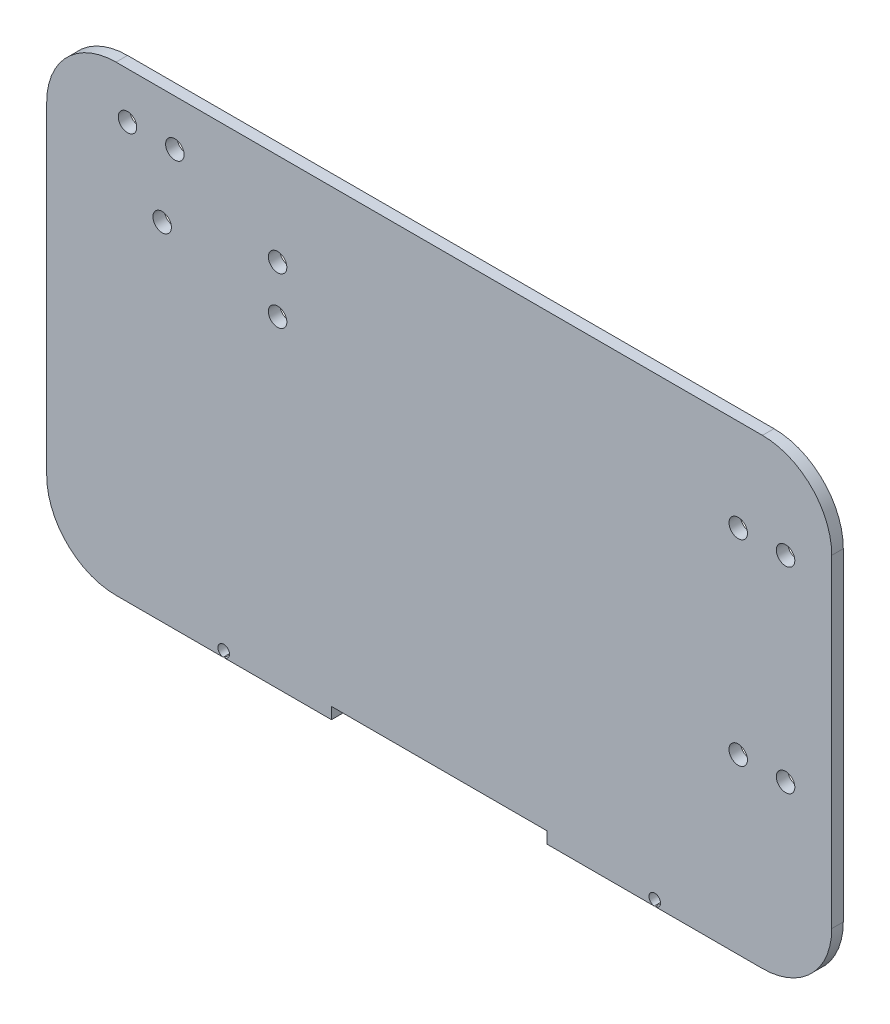
ISO-10303-21;
HEADER;
FILE_DESCRIPTION(('STEP AP214'),'2;1');
FILE_NAME('part.step','',(''),(''),'','','');
FILE_SCHEMA(('AUTOMOTIVE_DESIGN { 1 0 10303 214 1 1 1 1 }'));
ENDSEC;
DATA;
#1=APPLICATION_CONTEXT('core data for automotive mechanical design processes');
#2=APPLICATION_PROTOCOL_DEFINITION('international standard','automotive_design',2000,#1);
#3=PRODUCT_CONTEXT('',#1,'mechanical');
#4=PRODUCT('Part','Part','',(#3));
#5=PRODUCT_RELATED_PRODUCT_CATEGORY('part','',(#4));
#6=PRODUCT_DEFINITION_FORMATION('','',#4);
#7=PRODUCT_DEFINITION_CONTEXT('part definition',#1,'design');
#8=PRODUCT_DEFINITION('design','',#6,#7);
#9=PRODUCT_DEFINITION_SHAPE('','',#8);
#10=(LENGTH_UNIT() NAMED_UNIT(*) SI_UNIT(.MILLI.,.METRE.));
#11=(NAMED_UNIT(*) PLANE_ANGLE_UNIT() SI_UNIT($,.RADIAN.));
#12=(NAMED_UNIT(*) SI_UNIT($,.STERADIAN.) SOLID_ANGLE_UNIT());
#13=UNCERTAINTY_MEASURE_WITH_UNIT(LENGTH_MEASURE(1.E-05),#10,'distance_accuracy_value','');
#14=(GEOMETRIC_REPRESENTATION_CONTEXT(3) GLOBAL_UNCERTAINTY_ASSIGNED_CONTEXT((#13)) GLOBAL_UNIT_ASSIGNED_CONTEXT((#10,
#11,#12)) REPRESENTATION_CONTEXT('',''));
#15=CARTESIAN_POINT('',(0.,0.,0.));
#16=DIRECTION('',(0.,0.,1.));
#17=DIRECTION('',(1.,0.,0.));
#18=AXIS2_PLACEMENT_3D('',#15,#16,#17);
#19=CARTESIAN_POINT('',(-125.47242970477,-88.332065652522,5.));
#20=DIRECTION('',(0.,1.,0.));
#21=DIRECTION('',(0.,0.,1.));
#22=AXIS2_PLACEMENT_3D('',#19,#20,#21);
#23=PLANE('',#22);
#24=DIRECTION('',(1.,0.,0.));
#25=VECTOR('',#24,1.);
#26=CARTESIAN_POINT('',(-125.47242970477,-88.332065652522,0.));
#27=LINE('',#26,#25);
#28=CARTESIAN_POINT('',(61.1942369618966,-88.332065652522,0.));
#29=VERTEX_POINT('',#28);
#30=CARTESIAN_POINT('',(107.637520549526,-88.332065652522,0.));
#31=VERTEX_POINT('',#30);
#32=EDGE_CURVE('E160',#29,#31,#27,.T.);
#33=ORIENTED_EDGE('',*,*,#32,.T.);
#34=DIRECTION('',(0.,0.,1.));
#35=VECTOR('',#34,1.);
#36=CARTESIAN_POINT('',(107.637520549526,-88.332065652522,-5.));
#37=LINE('',#36,#35);
#38=CARTESIAN_POINT('',(107.637520549526,-88.332065652522,5.));
#39=VERTEX_POINT('',#38);
#40=EDGE_CURVE('E11',#31,#39,#37,.T.);
#41=ORIENTED_EDGE('',*,*,#40,.T.);
#42=DIRECTION('',(1.,0.,0.));
#43=VECTOR('',#42,1.);
#44=CARTESIAN_POINT('',(-125.47242970477,-88.332065652522,5.));
#45=LINE('',#44,#43);
#46=CARTESIAN_POINT('',(61.1942369618966,-88.332065652522,5.));
#47=VERTEX_POINT('',#46);
#48=EDGE_CURVE('E158',#47,#39,#45,.T.);
#49=ORIENTED_EDGE('',*,*,#48,.F.);
#50=DIRECTION('',(0.,0.,1.));
#51=VECTOR('',#50,1.);
#52=CARTESIAN_POINT('',(61.1942369618966,-88.332065652522,5.));
#53=LINE('',#52,#51);
#54=EDGE_CURVE('E239',#29,#47,#53,.T.);
#55=ORIENTED_EDGE('',*,*,#54,.F.);
#56=EDGE_LOOP('',(#33,#41,#49,#55));
#57=FACE_BOUND('',#56,.T.);
#58=ADVANCED_FACE('F37',(#57),#23,.F.);
#59=CARTESIAN_POINT('',(-125.47242970477,-88.332065652522,0.));
#60=VERTEX_POINT('',#59);
#61=CARTESIAN_POINT('',(-79.02914611714,-88.332065652522,0.));
#62=VERTEX_POINT('',#61);
#63=EDGE_CURVE('E197',#60,#62,#27,.T.);
#64=ORIENTED_EDGE('',*,*,#63,.T.);
#65=DIRECTION('',(0.,0.,1.));
#66=VECTOR('',#65,1.);
#67=CARTESIAN_POINT('',(-79.02914611714,-88.332065652522,-5.));
#68=LINE('',#67,#66);
#69=CARTESIAN_POINT('',(-79.02914611714,-88.332065652522,5.));
#70=VERTEX_POINT('',#69);
#71=EDGE_CURVE('E245',#62,#70,#68,.T.);
#72=ORIENTED_EDGE('',*,*,#71,.T.);
#73=CARTESIAN_POINT('',(-125.47242970477,-88.332065652522,5.));
#74=VERTEX_POINT('',#73);
#75=EDGE_CURVE('E170',#74,#70,#45,.T.);
#76=ORIENTED_EDGE('',*,*,#75,.F.);
#77=DIRECTION('',(0.,0.,-1.));
#78=VECTOR('',#77,1.);
#79=CARTESIAN_POINT('',(-125.47242970477,-88.332065652522,5.));
#80=LINE('',#79,#78);
#81=EDGE_CURVE('E233',#74,#60,#80,.T.);
#82=ORIENTED_EDGE('',*,*,#81,.T.);
#83=EDGE_LOOP('',(#64,#72,#76,#82));
#84=FACE_BOUND('',#83,.T.);
#85=ADVANCED_FACE('F337',(#84),#23,.F.);
#86=CARTESIAN_POINT('',(-125.47242970477,-58.332065652522,5.));
#87=DIRECTION('',(0.,0.,1.));
#88=DIRECTION('',(1.,0.,0.));
#89=AXIS2_PLACEMENT_3D('',#86,#87,#88);
#90=PLANE('',#89);
#91=CARTESIAN_POINT('',(107.860903628563,-85.842065652522,5.));
#92=DIRECTION('',(0.,0.,1.));
#93=DIRECTION('',(-1.,0.,0.));
#94=AXIS2_PLACEMENT_3D('',#91,#92,#93);
#95=CIRCLE('',#94,2.5);
#96=CARTESIAN_POINT('',(108.0842867076,-88.332065652522,5.));
#97=VERTEX_POINT('',#96);
#98=EDGE_CURVE('E148',#97,#39,#95,.T.);
#99=ORIENTED_EDGE('',*,*,#98,.F.);
#100=CARTESIAN_POINT('',(154.52757029523,-88.332065652522,5.));
#101=VERTEX_POINT('',#100);
#102=EDGE_CURVE('E168',#97,#101,#45,.T.);
#103=ORIENTED_EDGE('',*,*,#102,.T.);
#104=CARTESIAN_POINT('',(154.52757029523,-58.332065652522,5.));
#105=DIRECTION('',(0.,0.,1.));
#106=DIRECTION('',(1.,0.,0.));
#107=AXIS2_PLACEMENT_3D('',#104,#105,#106);
#108=CIRCLE('',#107,30.);
#109=CARTESIAN_POINT('',(184.52757029523,-58.332065652522,5.));
#110=VERTEX_POINT('',#109);
#111=EDGE_CURVE('E175',#101,#110,#108,.T.);
#112=ORIENTED_EDGE('',*,*,#111,.T.);
#113=DIRECTION('',(0.,1.,0.));
#114=VECTOR('',#113,1.);
#115=CARTESIAN_POINT('',(184.52757029523,-58.332065652522,5.));
#116=LINE('',#115,#114);
#117=CARTESIAN_POINT('',(184.52757029523,81.667934347478,5.));
#118=VERTEX_POINT('',#117);
#119=EDGE_CURVE('E178',#110,#118,#116,.T.);
#120=ORIENTED_EDGE('',*,*,#119,.T.);
#121=CARTESIAN_POINT('',(154.52757029523,81.667934347478,5.));
#122=DIRECTION('',(0.,0.,1.));
#123=DIRECTION('',(1.,0.,0.));
#124=AXIS2_PLACEMENT_3D('',#121,#122,#123);
#125=CIRCLE('',#124,30.);
#126=CARTESIAN_POINT('',(154.52757029523,111.667934347478,5.));
#127=VERTEX_POINT('',#126);
#128=EDGE_CURVE('E181',#118,#127,#125,.T.);
#129=ORIENTED_EDGE('',*,*,#128,.T.);
#130=DIRECTION('',(-1.,0.,0.));
#131=VECTOR('',#130,1.);
#132=CARTESIAN_POINT('',(154.52757029523,111.667934347478,5.));
#133=LINE('',#132,#131);
#134=CARTESIAN_POINT('',(-125.47242970477,111.667934347478,5.));
#135=VERTEX_POINT('',#134);
#136=EDGE_CURVE('E185',#127,#135,#133,.T.);
#137=ORIENTED_EDGE('',*,*,#136,.T.);
#138=CARTESIAN_POINT('',(-125.47242970477,81.667934347478,5.));
#139=DIRECTION('',(0.,0.,1.));
#140=DIRECTION('',(1.,0.,0.));
#141=AXIS2_PLACEMENT_3D('',#138,#139,#140);
#142=CIRCLE('',#141,30.);
#143=CARTESIAN_POINT('',(-155.47242970477,81.667934347478,5.));
#144=VERTEX_POINT('',#143);
#145=EDGE_CURVE('E187',#135,#144,#142,.T.);
#146=ORIENTED_EDGE('',*,*,#145,.T.);
#147=DIRECTION('',(0.,-1.,0.));
#148=VECTOR('',#147,1.);
#149=CARTESIAN_POINT('',(-155.47242970477,81.667934347478,5.));
#150=LINE('',#149,#148);
#151=CARTESIAN_POINT('',(-155.47242970477,-58.3320656525218,5.));
#152=VERTEX_POINT('',#151);
#153=EDGE_CURVE('E189',#144,#152,#150,.T.);
#154=ORIENTED_EDGE('',*,*,#153,.T.);
#155=CARTESIAN_POINT('',(-125.47242970477,-58.332065652522,5.));
#156=DIRECTION('',(0.,0.,1.));
#157=DIRECTION('',(1.,0.,0.));
#158=AXIS2_PLACEMENT_3D('',#155,#156,#157);
#159=CIRCLE('',#158,30.);
#160=EDGE_CURVE('E171',#152,#74,#159,.T.);
#161=ORIENTED_EDGE('',*,*,#160,.T.);
#162=ORIENTED_EDGE('',*,*,#75,.T.);
#163=CARTESIAN_POINT('',(-78.8057630381032,-85.842065652522,5.));
#164=DIRECTION('',(0.,0.,1.));
#165=DIRECTION('',(1.,0.,0.));
#166=AXIS2_PLACEMENT_3D('',#163,#164,#165);
#167=CIRCLE('',#166,2.5);
#168=CARTESIAN_POINT('',(-78.5823799590665,-88.332065652522,5.));
#169=VERTEX_POINT('',#168);
#170=EDGE_CURVE('E339',#169,#70,#167,.T.);
#171=ORIENTED_EDGE('',*,*,#170,.F.);
#172=CARTESIAN_POINT('',(-32.1390963714366,-88.332065652522,5.));
#173=VERTEX_POINT('',#172);
#174=EDGE_CURVE('E167',#169,#173,#45,.T.);
#175=ORIENTED_EDGE('',*,*,#174,.T.);
#176=DIRECTION('',(0.,-1.,0.));
#177=VECTOR('',#176,1.);
#178=CARTESIAN_POINT('',(-32.1390963714366,0.,5.));
#179=LINE('',#178,#177);
#180=CARTESIAN_POINT('',(-32.1390963714366,-83.332065652522,5.));
#181=VERTEX_POINT('',#180);
#182=EDGE_CURVE('E267',#181,#173,#179,.T.);
#183=ORIENTED_EDGE('',*,*,#182,.F.);
#184=DIRECTION('',(1.,0.,0.));
#185=VECTOR('',#184,1.);
#186=CARTESIAN_POINT('',(0.,-83.332065652522,5.));
#187=LINE('',#186,#185);
#188=CARTESIAN_POINT('',(61.1942369618966,-83.332065652522,5.));
#189=VERTEX_POINT('',#188);
#190=EDGE_CURVE('E341',#181,#189,#187,.T.);
#191=ORIENTED_EDGE('',*,*,#190,.T.);
#192=DIRECTION('',(0.,-1.,0.));
#193=VECTOR('',#192,1.);
#194=CARTESIAN_POINT('',(61.1942369618966,0.,5.));
#195=LINE('',#194,#193);
#196=EDGE_CURVE('E166',#189,#47,#195,.T.);
#197=ORIENTED_EDGE('',*,*,#196,.T.);
#198=ORIENTED_EDGE('',*,*,#48,.T.);
#199=EDGE_LOOP('',(#99,#103,#112,#120,#129,#137,#146,#154,#161,#162,#171,#175,#183,#191,#197,#198));
#200=FACE_BOUND('',#199,.T.);
#201=CARTESIAN_POINT('',(-99.9724297047701,91.667934347478,5.));
#202=DIRECTION('',(0.,0.,1.));
#203=DIRECTION('',(1.,0.,0.));
#204=AXIS2_PLACEMENT_3D('',#201,#202,#203);
#205=CIRCLE('',#204,3.99999999999999);
#206=CARTESIAN_POINT('',(-95.9724297047701,91.667934347478,5.));
#207=VERTEX_POINT('',#206);
#208=EDGE_CURVE('E285',#207,#207,#205,.T.);
#209=ORIENTED_EDGE('',*,*,#208,.F.);
#210=EDGE_LOOP('',(#209));
#211=FACE_BOUND('',#210,.T.);
#212=CARTESIAN_POINT('',(144.02757029523,71.667934347478,5.));
#213=DIRECTION('',(0.,0.,1.));
#214=DIRECTION('',(1.,0.,0.));
#215=AXIS2_PLACEMENT_3D('',#212,#213,#214);
#216=CIRCLE('',#215,3.99999999999999);
#217=CARTESIAN_POINT('',(148.02757029523,71.667934347478,5.));
#218=VERTEX_POINT('',#217);
#219=EDGE_CURVE('E297',#218,#218,#216,.T.);
#220=ORIENTED_EDGE('',*,*,#219,.F.);
#221=EDGE_LOOP('',(#220));
#222=FACE_BOUND('',#221,.T.);
#223=CARTESIAN_POINT('',(144.02757029523,-13.332065652522,5.));
#224=DIRECTION('',(0.,0.,1.));
#225=DIRECTION('',(1.,0.,0.));
#226=AXIS2_PLACEMENT_3D('',#223,#224,#225);
#227=CIRCLE('',#226,3.99999999999999);
#228=CARTESIAN_POINT('',(148.02757029523,-13.332065652522,5.));
#229=VERTEX_POINT('',#228);
#230=EDGE_CURVE('E309',#229,#229,#227,.T.);
#231=ORIENTED_EDGE('',*,*,#230,.F.);
#232=EDGE_LOOP('',(#231));
#233=FACE_BOUND('',#232,.T.);
#234=CARTESIAN_POINT('',(-55.4724297047701,71.667934347478,5.));
#235=DIRECTION('',(0.,0.,1.));
#236=DIRECTION('',(1.,0.,0.));
#237=AXIS2_PLACEMENT_3D('',#234,#235,#236);
#238=CIRCLE('',#237,4.00000000000001);
#239=CARTESIAN_POINT('',(-51.4724297047701,71.667934347478,5.));
#240=VERTEX_POINT('',#239);
#241=EDGE_CURVE('E321',#240,#240,#238,.T.);
#242=ORIENTED_EDGE('',*,*,#241,.F.);
#243=EDGE_LOOP('',(#242));
#244=FACE_BOUND('',#243,.T.);
#245=CARTESIAN_POINT('',(-105.47242970477,61.667934347478,5.));
#246=DIRECTION('',(0.,0.,1.));
#247=DIRECTION('',(1.,0.,0.));
#248=AXIS2_PLACEMENT_3D('',#245,#246,#247);
#249=CIRCLE('',#248,4.00000000000001);
#250=CARTESIAN_POINT('',(-101.47242970477,61.667934347478,5.));
#251=VERTEX_POINT('',#250);
#252=EDGE_CURVE('E196',#251,#251,#249,.T.);
#253=ORIENTED_EDGE('',*,*,#252,.F.);
#254=EDGE_LOOP('',(#253));
#255=FACE_BOUND('',#254,.T.);
#256=CARTESIAN_POINT('',(-55.4724297047701,51.167934347478,5.));
#257=DIRECTION('',(0.,0.,1.));
#258=DIRECTION('',(1.,0.,0.));
#259=AXIS2_PLACEMENT_3D('',#256,#257,#258);
#260=CIRCLE('',#259,4.00000000000001);
#261=CARTESIAN_POINT('',(-51.4724297047701,51.167934347478,5.));
#262=VERTEX_POINT('',#261);
#263=EDGE_CURVE('E315',#262,#262,#260,.T.);
#264=ORIENTED_EDGE('',*,*,#263,.F.);
#265=EDGE_LOOP('',(#264));
#266=FACE_BOUND('',#265,.T.);
#267=CARTESIAN_POINT('',(164.52757029523,-13.332065652522,5.));
#268=DIRECTION('',(0.,0.,1.));
#269=DIRECTION('',(1.,0.,0.));
#270=AXIS2_PLACEMENT_3D('',#267,#268,#269);
#271=CIRCLE('',#270,3.99999999999999);
#272=CARTESIAN_POINT('',(168.52757029523,-13.332065652522,5.));
#273=VERTEX_POINT('',#272);
#274=EDGE_CURVE('E303',#273,#273,#271,.T.);
#275=ORIENTED_EDGE('',*,*,#274,.F.);
#276=EDGE_LOOP('',(#275));
#277=FACE_BOUND('',#276,.T.);
#278=CARTESIAN_POINT('',(164.52757029523,71.667934347478,5.));
#279=DIRECTION('',(0.,0.,1.));
#280=DIRECTION('',(1.,0.,0.));
#281=AXIS2_PLACEMENT_3D('',#278,#279,#280);
#282=CIRCLE('',#281,3.99999999999999);
#283=CARTESIAN_POINT('',(168.52757029523,71.667934347478,5.));
#284=VERTEX_POINT('',#283);
#285=EDGE_CURVE('E291',#284,#284,#282,.T.);
#286=ORIENTED_EDGE('',*,*,#285,.F.);
#287=EDGE_LOOP('',(#286));
#288=FACE_BOUND('',#287,.T.);
#289=CARTESIAN_POINT('',(-120.47242970477,91.667934347478,5.));
#290=DIRECTION('',(0.,0.,1.));
#291=DIRECTION('',(1.,0.,0.));
#292=AXIS2_PLACEMENT_3D('',#289,#290,#291);
#293=CIRCLE('',#292,3.99999999999999);
#294=CARTESIAN_POINT('',(-116.47242970477,91.667934347478,5.));
#295=VERTEX_POINT('',#294);
#296=EDGE_CURVE('E279',#295,#295,#293,.T.);
#297=ORIENTED_EDGE('',*,*,#296,.F.);
#298=EDGE_LOOP('',(#297));
#299=FACE_BOUND('',#298,.T.);
#300=ADVANCED_FACE('F162',(#200,#211,#222,#233,#244,#255,#266,#277,#288,#299),#90,.T.);
#301=CARTESIAN_POINT('',(-125.47242970477,-58.332065652522,0.));
#302=DIRECTION('',(0.,0.,1.));
#303=DIRECTION('',(1.,0.,0.));
#304=AXIS2_PLACEMENT_3D('',#301,#302,#303);
#305=PLANE('',#304);
#306=CARTESIAN_POINT('',(-120.47242970477,91.667934347478,0.));
#307=DIRECTION('',(0.,0.,1.));
#308=DIRECTION('',(1.,0.,0.));
#309=AXIS2_PLACEMENT_3D('',#306,#307,#308);
#310=CIRCLE('',#309,3.99999999999999);
#311=CARTESIAN_POINT('',(-116.47242970477,91.667934347478,0.));
#312=VERTEX_POINT('',#311);
#313=EDGE_CURVE('E273',#312,#312,#310,.T.);
#314=ORIENTED_EDGE('',*,*,#313,.T.);
#315=EDGE_LOOP('',(#314));
#316=FACE_BOUND('',#315,.T.);
#317=CARTESIAN_POINT('',(-99.9724297047701,91.667934347478,0.));
#318=DIRECTION('',(0.,0.,1.));
#319=DIRECTION('',(1.,0.,0.));
#320=AXIS2_PLACEMENT_3D('',#317,#318,#319);
#321=CIRCLE('',#320,3.99999999999999);
#322=CARTESIAN_POINT('',(-95.9724297047701,91.667934347478,0.));
#323=VERTEX_POINT('',#322);
#324=EDGE_CURVE('E282',#323,#323,#321,.T.);
#325=ORIENTED_EDGE('',*,*,#324,.T.);
#326=EDGE_LOOP('',(#325));
#327=FACE_BOUND('',#326,.T.);
#328=CARTESIAN_POINT('',(164.52757029523,71.667934347478,0.));
#329=DIRECTION('',(0.,0.,1.));
#330=DIRECTION('',(1.,0.,0.));
#331=AXIS2_PLACEMENT_3D('',#328,#329,#330);
#332=CIRCLE('',#331,3.99999999999999);
#333=CARTESIAN_POINT('',(168.52757029523,71.667934347478,0.));
#334=VERTEX_POINT('',#333);
#335=EDGE_CURVE('E288',#334,#334,#332,.T.);
#336=ORIENTED_EDGE('',*,*,#335,.T.);
#337=EDGE_LOOP('',(#336));
#338=FACE_BOUND('',#337,.T.);
#339=CARTESIAN_POINT('',(144.02757029523,71.667934347478,0.));
#340=DIRECTION('',(0.,0.,1.));
#341=DIRECTION('',(1.,0.,0.));
#342=AXIS2_PLACEMENT_3D('',#339,#340,#341);
#343=CIRCLE('',#342,3.99999999999999);
#344=CARTESIAN_POINT('',(148.02757029523,71.667934347478,0.));
#345=VERTEX_POINT('',#344);
#346=EDGE_CURVE('E294',#345,#345,#343,.T.);
#347=ORIENTED_EDGE('',*,*,#346,.T.);
#348=EDGE_LOOP('',(#347));
#349=FACE_BOUND('',#348,.T.);
#350=CARTESIAN_POINT('',(164.52757029523,-13.332065652522,0.));
#351=DIRECTION('',(0.,0.,1.));
#352=DIRECTION('',(1.,0.,0.));
#353=AXIS2_PLACEMENT_3D('',#350,#351,#352);
#354=CIRCLE('',#353,3.99999999999999);
#355=CARTESIAN_POINT('',(168.52757029523,-13.332065652522,0.));
#356=VERTEX_POINT('',#355);
#357=EDGE_CURVE('E300',#356,#356,#354,.T.);
#358=ORIENTED_EDGE('',*,*,#357,.T.);
#359=EDGE_LOOP('',(#358));
#360=FACE_BOUND('',#359,.T.);
#361=CARTESIAN_POINT('',(144.02757029523,-13.332065652522,0.));
#362=DIRECTION('',(0.,0.,1.));
#363=DIRECTION('',(1.,0.,0.));
#364=AXIS2_PLACEMENT_3D('',#361,#362,#363);
#365=CIRCLE('',#364,3.99999999999999);
#366=CARTESIAN_POINT('',(148.02757029523,-13.332065652522,0.));
#367=VERTEX_POINT('',#366);
#368=EDGE_CURVE('E306',#367,#367,#365,.T.);
#369=ORIENTED_EDGE('',*,*,#368,.T.);
#370=EDGE_LOOP('',(#369));
#371=FACE_BOUND('',#370,.T.);
#372=CARTESIAN_POINT('',(-55.4724297047701,51.167934347478,0.));
#373=DIRECTION('',(0.,0.,1.));
#374=DIRECTION('',(1.,0.,0.));
#375=AXIS2_PLACEMENT_3D('',#372,#373,#374);
#376=CIRCLE('',#375,4.00000000000001);
#377=CARTESIAN_POINT('',(-51.4724297047701,51.167934347478,0.));
#378=VERTEX_POINT('',#377);
#379=EDGE_CURVE('E312',#378,#378,#376,.T.);
#380=ORIENTED_EDGE('',*,*,#379,.T.);
#381=EDGE_LOOP('',(#380));
#382=FACE_BOUND('',#381,.T.);
#383=CARTESIAN_POINT('',(-55.4724297047701,71.667934347478,0.));
#384=DIRECTION('',(0.,0.,1.));
#385=DIRECTION('',(1.,0.,0.));
#386=AXIS2_PLACEMENT_3D('',#383,#384,#385);
#387=CIRCLE('',#386,4.00000000000001);
#388=CARTESIAN_POINT('',(-51.4724297047701,71.667934347478,0.));
#389=VERTEX_POINT('',#388);
#390=EDGE_CURVE('E318',#389,#389,#387,.T.);
#391=ORIENTED_EDGE('',*,*,#390,.T.);
#392=EDGE_LOOP('',(#391));
#393=FACE_BOUND('',#392,.T.);
#394=CARTESIAN_POINT('',(-105.47242970477,61.667934347478,0.));
#395=DIRECTION('',(0.,0.,1.));
#396=DIRECTION('',(1.,0.,0.));
#397=AXIS2_PLACEMENT_3D('',#394,#395,#396);
#398=CIRCLE('',#397,4.00000000000001);
#399=CARTESIAN_POINT('',(-101.47242970477,61.667934347478,0.));
#400=VERTEX_POINT('',#399);
#401=EDGE_CURVE('E324',#400,#400,#398,.T.);
#402=ORIENTED_EDGE('',*,*,#401,.T.);
#403=EDGE_LOOP('',(#402));
#404=FACE_BOUND('',#403,.T.);
#405=CARTESIAN_POINT('',(108.0842867076,-88.332065652522,0.));
#406=VERTEX_POINT('',#405);
#407=CARTESIAN_POINT('',(154.52757029523,-88.332065652522,0.));
#408=VERTEX_POINT('',#407);
#409=EDGE_CURVE('E195',#406,#408,#27,.T.);
#410=ORIENTED_EDGE('',*,*,#409,.F.);
#411=CARTESIAN_POINT('',(107.860903628563,-85.842065652522,0.));
#412=DIRECTION('',(0.,0.,1.));
#413=DIRECTION('',(1.,0.,0.));
#414=AXIS2_PLACEMENT_3D('',#411,#412,#413);
#415=CIRCLE('',#414,2.5);
#416=EDGE_CURVE('E52',#406,#31,#415,.T.);
#417=ORIENTED_EDGE('',*,*,#416,.T.);
#418=ORIENTED_EDGE('',*,*,#32,.F.);
#419=DIRECTION('',(0.,-1.,0.));
#420=VECTOR('',#419,1.);
#421=CARTESIAN_POINT('',(61.1942369618966,-58.332065652522,0.));
#422=LINE('',#421,#420);
#423=CARTESIAN_POINT('',(61.1942369618966,-83.332065652522,0.));
#424=VERTEX_POINT('',#423);
#425=EDGE_CURVE('E270',#424,#29,#422,.T.);
#426=ORIENTED_EDGE('',*,*,#425,.F.);
#427=DIRECTION('',(1.,0.,0.));
#428=VECTOR('',#427,1.);
#429=CARTESIAN_POINT('',(-125.47242970477,-83.332065652522,0.));
#430=LINE('',#429,#428);
#431=CARTESIAN_POINT('',(-32.1390963714366,-83.332065652522,0.));
#432=VERTEX_POINT('',#431);
#433=EDGE_CURVE('E241',#432,#424,#430,.T.);
#434=ORIENTED_EDGE('',*,*,#433,.F.);
#435=DIRECTION('',(0.,-1.,0.));
#436=VECTOR('',#435,1.);
#437=CARTESIAN_POINT('',(-32.1390963714366,-58.332065652522,0.));
#438=LINE('',#437,#436);
#439=CARTESIAN_POINT('',(-32.1390963714366,-88.332065652522,0.));
#440=VERTEX_POINT('',#439);
#441=EDGE_CURVE('E264',#432,#440,#438,.T.);
#442=ORIENTED_EDGE('',*,*,#441,.T.);
#443=CARTESIAN_POINT('',(-78.5823799590665,-88.332065652522,0.));
#444=VERTEX_POINT('',#443);
#445=EDGE_CURVE('E201',#444,#440,#27,.T.);
#446=ORIENTED_EDGE('',*,*,#445,.F.);
#447=CARTESIAN_POINT('',(-78.8057630381032,-85.842065652522,0.));
#448=DIRECTION('',(0.,0.,1.));
#449=DIRECTION('',(1.,0.,0.));
#450=AXIS2_PLACEMENT_3D('',#447,#448,#449);
#451=CIRCLE('',#450,2.5);
#452=EDGE_CURVE('E60',#444,#62,#451,.T.);
#453=ORIENTED_EDGE('',*,*,#452,.T.);
#454=ORIENTED_EDGE('',*,*,#63,.F.);
#455=CARTESIAN_POINT('',(-125.47242970477,-58.332065652522,0.));
#456=DIRECTION('',(0.,0.,1.));
#457=DIRECTION('',(1.,0.,0.));
#458=AXIS2_PLACEMENT_3D('',#455,#456,#457);
#459=CIRCLE('',#458,30.);
#460=CARTESIAN_POINT('',(-155.47242970477,-58.3320656525218,0.));
#461=VERTEX_POINT('',#460);
#462=EDGE_CURVE('E192',#461,#60,#459,.T.);
#463=ORIENTED_EDGE('',*,*,#462,.F.);
#464=DIRECTION('',(0.,-1.,0.));
#465=VECTOR('',#464,1.);
#466=CARTESIAN_POINT('',(-155.47242970477,81.667934347478,0.));
#467=LINE('',#466,#465);
#468=CARTESIAN_POINT('',(-155.47242970477,81.667934347478,0.));
#469=VERTEX_POINT('',#468);
#470=EDGE_CURVE('E211',#469,#461,#467,.T.);
#471=ORIENTED_EDGE('',*,*,#470,.F.);
#472=CARTESIAN_POINT('',(-125.47242970477,81.667934347478,0.));
#473=DIRECTION('',(0.,0.,1.));
#474=DIRECTION('',(1.,0.,0.));
#475=AXIS2_PLACEMENT_3D('',#472,#473,#474);
#476=CIRCLE('',#475,30.);
#477=CARTESIAN_POINT('',(-125.47242970477,111.667934347478,0.));
#478=VERTEX_POINT('',#477);
#479=EDGE_CURVE('E209',#478,#469,#476,.T.);
#480=ORIENTED_EDGE('',*,*,#479,.F.);
#481=DIRECTION('',(-1.,0.,0.));
#482=VECTOR('',#481,1.);
#483=CARTESIAN_POINT('',(154.52757029523,111.667934347478,0.));
#484=LINE('',#483,#482);
#485=CARTESIAN_POINT('',(154.52757029523,111.667934347478,0.));
#486=VERTEX_POINT('',#485);
#487=EDGE_CURVE('E207',#486,#478,#484,.T.);
#488=ORIENTED_EDGE('',*,*,#487,.F.);
#489=CARTESIAN_POINT('',(154.52757029523,81.667934347478,0.));
#490=DIRECTION('',(0.,0.,1.));
#491=DIRECTION('',(1.,0.,0.));
#492=AXIS2_PLACEMENT_3D('',#489,#490,#491);
#493=CIRCLE('',#492,30.);
#494=CARTESIAN_POINT('',(184.52757029523,81.667934347478,0.));
#495=VERTEX_POINT('',#494);
#496=EDGE_CURVE('E205',#495,#486,#493,.T.);
#497=ORIENTED_EDGE('',*,*,#496,.F.);
#498=DIRECTION('',(0.,1.,0.));
#499=VECTOR('',#498,1.);
#500=CARTESIAN_POINT('',(184.52757029523,-58.332065652522,0.));
#501=LINE('',#500,#499);
#502=CARTESIAN_POINT('',(184.52757029523,-58.332065652522,0.));
#503=VERTEX_POINT('',#502);
#504=EDGE_CURVE('E203',#503,#495,#501,.T.);
#505=ORIENTED_EDGE('',*,*,#504,.F.);
#506=CARTESIAN_POINT('',(154.52757029523,-58.332065652522,0.));
#507=DIRECTION('',(0.,0.,1.));
#508=DIRECTION('',(1.,0.,0.));
#509=AXIS2_PLACEMENT_3D('',#506,#507,#508);
#510=CIRCLE('',#509,30.);
#511=EDGE_CURVE('E200',#408,#503,#510,.T.);
#512=ORIENTED_EDGE('',*,*,#511,.F.);
#513=EDGE_LOOP('',(#410,#417,#418,#426,#434,#442,#446,#453,#454,#463,#471,#480,#488,#497,#505,#512));
#514=FACE_BOUND('',#513,.T.);
#515=ADVANCED_FACE('F253',(#316,#327,#338,#349,#360,#371,#382,#393,#404,#514),#305,.F.);
#516=ORIENTED_EDGE('',*,*,#102,.F.);
#517=DIRECTION('',(0.,0.,1.));
#518=VECTOR('',#517,1.);
#519=CARTESIAN_POINT('',(108.0842867076,-88.332065652522,-5.));
#520=LINE('',#519,#518);
#521=EDGE_CURVE('E45',#97,#406,#520,.F.);
#522=ORIENTED_EDGE('',*,*,#521,.T.);
#523=ORIENTED_EDGE('',*,*,#409,.T.);
#524=DIRECTION('',(0.,0.,-1.));
#525=VECTOR('',#524,1.);
#526=CARTESIAN_POINT('',(154.52757029523,-88.332065652522,5.));
#527=LINE('',#526,#525);
#528=EDGE_CURVE('E230',#101,#408,#527,.T.);
#529=ORIENTED_EDGE('',*,*,#528,.F.);
#530=EDGE_LOOP('',(#516,#522,#523,#529));
#531=FACE_BOUND('',#530,.T.);
#532=ADVANCED_FACE('F249',(#531),#23,.F.);
#533=CARTESIAN_POINT('',(-125.47242970477,-58.332065652522,5.));
#534=DIRECTION('',(0.,0.,-1.));
#535=DIRECTION('',(-1.,0.,0.));
#536=AXIS2_PLACEMENT_3D('',#533,#534,#535);
#537=CYLINDRICAL_SURFACE('',#536,30.);
#538=ORIENTED_EDGE('',*,*,#462,.T.);
#539=ORIENTED_EDGE('',*,*,#81,.F.);
#540=ORIENTED_EDGE('',*,*,#160,.F.);
#541=DIRECTION('',(0.,0.,-1.));
#542=VECTOR('',#541,1.);
#543=CARTESIAN_POINT('',(-155.47242970477,-58.3320656525218,5.));
#544=LINE('',#543,#542);
#545=EDGE_CURVE('E191',#152,#461,#544,.T.);
#546=ORIENTED_EDGE('',*,*,#545,.T.);
#547=EDGE_LOOP('',(#538,#539,#540,#546));
#548=FACE_BOUND('',#547,.T.);
#549=ADVANCED_FACE('F39',(#548),#537,.T.);
#550=ORIENTED_EDGE('',*,*,#174,.F.);
#551=DIRECTION('',(0.,0.,1.));
#552=VECTOR('',#551,1.);
#553=CARTESIAN_POINT('',(-78.5823799590665,-88.332065652522,-5.));
#554=LINE('',#553,#552);
#555=EDGE_CURVE('E243',#169,#444,#554,.F.);
#556=ORIENTED_EDGE('',*,*,#555,.T.);
#557=ORIENTED_EDGE('',*,*,#445,.T.);
#558=DIRECTION('',(0.,0.,1.));
#559=VECTOR('',#558,1.);
#560=CARTESIAN_POINT('',(-32.1390963714366,-88.332065652522,5.));
#561=LINE('',#560,#559);
#562=EDGE_CURVE('E236',#440,#173,#561,.T.);
#563=ORIENTED_EDGE('',*,*,#562,.T.);
#564=EDGE_LOOP('',(#550,#556,#557,#563));
#565=FACE_BOUND('',#564,.T.);
#566=ADVANCED_FACE('F259',(#565),#23,.F.);
#567=CARTESIAN_POINT('',(154.52757029523,-58.332065652522,5.));
#568=DIRECTION('',(0.,0.,-1.));
#569=DIRECTION('',(-1.,0.,0.));
#570=AXIS2_PLACEMENT_3D('',#567,#568,#569);
#571=CYLINDRICAL_SURFACE('',#570,30.);
#572=ORIENTED_EDGE('',*,*,#511,.T.);
#573=DIRECTION('',(0.,0.,-1.));
#574=VECTOR('',#573,1.);
#575=CARTESIAN_POINT('',(184.52757029523,-58.332065652522,5.));
#576=LINE('',#575,#574);
#577=EDGE_CURVE('E227',#110,#503,#576,.T.);
#578=ORIENTED_EDGE('',*,*,#577,.F.);
#579=ORIENTED_EDGE('',*,*,#111,.F.);
#580=ORIENTED_EDGE('',*,*,#528,.T.);
#581=EDGE_LOOP('',(#572,#578,#579,#580));
#582=FACE_BOUND('',#581,.T.);
#583=ADVANCED_FACE('F370',(#582),#571,.T.);
#584=CARTESIAN_POINT('',(184.52757029523,-58.332065652522,5.));
#585=DIRECTION('',(-1.,0.,0.));
#586=DIRECTION('',(0.,0.,1.));
#587=AXIS2_PLACEMENT_3D('',#584,#585,#586);
#588=PLANE('',#587);
#589=ORIENTED_EDGE('',*,*,#504,.T.);
#590=DIRECTION('',(0.,0.,-1.));
#591=VECTOR('',#590,1.);
#592=CARTESIAN_POINT('',(184.52757029523,81.667934347478,5.));
#593=LINE('',#592,#591);
#594=EDGE_CURVE('E224',#118,#495,#593,.T.);
#595=ORIENTED_EDGE('',*,*,#594,.F.);
#596=ORIENTED_EDGE('',*,*,#119,.F.);
#597=ORIENTED_EDGE('',*,*,#577,.T.);
#598=EDGE_LOOP('',(#589,#595,#596,#597));
#599=FACE_BOUND('',#598,.T.);
#600=ADVANCED_FACE('F376',(#599),#588,.F.);
#601=CARTESIAN_POINT('',(154.52757029523,81.667934347478,5.));
#602=DIRECTION('',(0.,0.,-1.));
#603=DIRECTION('',(-1.,0.,0.));
#604=AXIS2_PLACEMENT_3D('',#601,#602,#603);
#605=CYLINDRICAL_SURFACE('',#604,30.);
#606=ORIENTED_EDGE('',*,*,#496,.T.);
#607=DIRECTION('',(0.,0.,-1.));
#608=VECTOR('',#607,1.);
#609=CARTESIAN_POINT('',(154.52757029523,111.667934347478,5.));
#610=LINE('',#609,#608);
#611=EDGE_CURVE('E221',#127,#486,#610,.T.);
#612=ORIENTED_EDGE('',*,*,#611,.F.);
#613=ORIENTED_EDGE('',*,*,#128,.F.);
#614=ORIENTED_EDGE('',*,*,#594,.T.);
#615=EDGE_LOOP('',(#606,#612,#613,#614));
#616=FACE_BOUND('',#615,.T.);
#617=ADVANCED_FACE('F403',(#616),#605,.T.);
#618=CARTESIAN_POINT('',(154.52757029523,111.667934347478,5.));
#619=DIRECTION('',(0.,-1.,0.));
#620=DIRECTION('',(1.,0.,0.));
#621=AXIS2_PLACEMENT_3D('',#618,#619,#620);
#622=PLANE('',#621);
#623=ORIENTED_EDGE('',*,*,#487,.T.);
#624=DIRECTION('',(0.,0.,-1.));
#625=VECTOR('',#624,1.);
#626=CARTESIAN_POINT('',(-125.47242970477,111.667934347478,5.));
#627=LINE('',#626,#625);
#628=EDGE_CURVE('E218',#135,#478,#627,.T.);
#629=ORIENTED_EDGE('',*,*,#628,.F.);
#630=ORIENTED_EDGE('',*,*,#136,.F.);
#631=ORIENTED_EDGE('',*,*,#611,.T.);
#632=EDGE_LOOP('',(#623,#629,#630,#631));
#633=FACE_BOUND('',#632,.T.);
#634=ADVANCED_FACE('F399',(#633),#622,.F.);
#635=CARTESIAN_POINT('',(-125.47242970477,81.667934347478,5.));
#636=DIRECTION('',(0.,0.,-1.));
#637=DIRECTION('',(-1.,0.,0.));
#638=AXIS2_PLACEMENT_3D('',#635,#636,#637);
#639=CYLINDRICAL_SURFACE('',#638,30.);
#640=ORIENTED_EDGE('',*,*,#479,.T.);
#641=DIRECTION('',(0.,0.,-1.));
#642=VECTOR('',#641,1.);
#643=CARTESIAN_POINT('',(-155.47242970477,81.667934347478,5.));
#644=LINE('',#643,#642);
#645=EDGE_CURVE('E215',#144,#469,#644,.T.);
#646=ORIENTED_EDGE('',*,*,#645,.F.);
#647=ORIENTED_EDGE('',*,*,#145,.F.);
#648=ORIENTED_EDGE('',*,*,#628,.T.);
#649=EDGE_LOOP('',(#640,#646,#647,#648));
#650=FACE_BOUND('',#649,.T.);
#651=ADVANCED_FACE('F395',(#650),#639,.T.);
#652=CARTESIAN_POINT('',(-155.47242970477,81.667934347478,5.));
#653=DIRECTION('',(1.,0.,0.));
#654=DIRECTION('',(0.,0.,-1.));
#655=AXIS2_PLACEMENT_3D('',#652,#653,#654);
#656=PLANE('',#655);
#657=ORIENTED_EDGE('',*,*,#470,.T.);
#658=ORIENTED_EDGE('',*,*,#545,.F.);
#659=ORIENTED_EDGE('',*,*,#153,.F.);
#660=ORIENTED_EDGE('',*,*,#645,.T.);
#661=EDGE_LOOP('',(#657,#658,#659,#660));
#662=FACE_BOUND('',#661,.T.);
#663=ADVANCED_FACE('F391',(#662),#656,.F.);
#664=CARTESIAN_POINT('',(-105.47242970477,61.667934347478,5.));
#665=DIRECTION('',(0.,0.,-1.));
#666=DIRECTION('',(-1.,0.,0.));
#667=AXIS2_PLACEMENT_3D('',#664,#665,#666);
#668=CYLINDRICAL_SURFACE('',#667,4.00000000000001);
#669=ORIENTED_EDGE('',*,*,#252,.T.);
#670=EDGE_LOOP('',(#669));
#671=FACE_BOUND('',#670,.T.);
#672=ORIENTED_EDGE('',*,*,#401,.F.);
#673=EDGE_LOOP('',(#672));
#674=FACE_BOUND('',#673,.T.);
#675=ADVANCED_FACE('F394',(#671,#674),#668,.F.);
#676=CARTESIAN_POINT('',(-55.4724297047701,71.667934347478,5.));
#677=DIRECTION('',(0.,0.,-1.));
#678=DIRECTION('',(-1.,0.,0.));
#679=AXIS2_PLACEMENT_3D('',#676,#677,#678);
#680=CYLINDRICAL_SURFACE('',#679,4.00000000000001);
#681=ORIENTED_EDGE('',*,*,#241,.T.);
#682=EDGE_LOOP('',(#681));
#683=FACE_BOUND('',#682,.T.);
#684=ORIENTED_EDGE('',*,*,#390,.F.);
#685=EDGE_LOOP('',(#684));
#686=FACE_BOUND('',#685,.T.);
#687=ADVANCED_FACE('F448',(#683,#686),#680,.F.);
#688=CARTESIAN_POINT('',(-55.4724297047701,51.167934347478,5.));
#689=DIRECTION('',(0.,0.,-1.));
#690=DIRECTION('',(-1.,0.,0.));
#691=AXIS2_PLACEMENT_3D('',#688,#689,#690);
#692=CYLINDRICAL_SURFACE('',#691,4.00000000000001);
#693=ORIENTED_EDGE('',*,*,#263,.T.);
#694=EDGE_LOOP('',(#693));
#695=FACE_BOUND('',#694,.T.);
#696=ORIENTED_EDGE('',*,*,#379,.F.);
#697=EDGE_LOOP('',(#696));
#698=FACE_BOUND('',#697,.T.);
#699=ADVANCED_FACE('F455',(#695,#698),#692,.F.);
#700=CARTESIAN_POINT('',(144.02757029523,-13.332065652522,5.));
#701=DIRECTION('',(0.,0.,-1.));
#702=DIRECTION('',(-1.,0.,0.));
#703=AXIS2_PLACEMENT_3D('',#700,#701,#702);
#704=CYLINDRICAL_SURFACE('',#703,3.99999999999999);
#705=ORIENTED_EDGE('',*,*,#230,.T.);
#706=EDGE_LOOP('',(#705));
#707=FACE_BOUND('',#706,.T.);
#708=ORIENTED_EDGE('',*,*,#368,.F.);
#709=EDGE_LOOP('',(#708));
#710=FACE_BOUND('',#709,.T.);
#711=ADVANCED_FACE('F463',(#707,#710),#704,.F.);
#712=CARTESIAN_POINT('',(164.52757029523,-13.332065652522,5.));
#713=DIRECTION('',(0.,0.,-1.));
#714=DIRECTION('',(-1.,0.,0.));
#715=AXIS2_PLACEMENT_3D('',#712,#713,#714);
#716=CYLINDRICAL_SURFACE('',#715,3.99999999999999);
#717=ORIENTED_EDGE('',*,*,#274,.T.);
#718=EDGE_LOOP('',(#717));
#719=FACE_BOUND('',#718,.T.);
#720=ORIENTED_EDGE('',*,*,#357,.F.);
#721=EDGE_LOOP('',(#720));
#722=FACE_BOUND('',#721,.T.);
#723=ADVANCED_FACE('F471',(#719,#722),#716,.F.);
#724=CARTESIAN_POINT('',(144.02757029523,71.667934347478,5.));
#725=DIRECTION('',(0.,0.,-1.));
#726=DIRECTION('',(-1.,0.,0.));
#727=AXIS2_PLACEMENT_3D('',#724,#725,#726);
#728=CYLINDRICAL_SURFACE('',#727,3.99999999999999);
#729=ORIENTED_EDGE('',*,*,#219,.T.);
#730=EDGE_LOOP('',(#729));
#731=FACE_BOUND('',#730,.T.);
#732=ORIENTED_EDGE('',*,*,#346,.F.);
#733=EDGE_LOOP('',(#732));
#734=FACE_BOUND('',#733,.T.);
#735=ADVANCED_FACE('F479',(#731,#734),#728,.F.);
#736=CARTESIAN_POINT('',(164.52757029523,71.667934347478,5.));
#737=DIRECTION('',(0.,0.,-1.));
#738=DIRECTION('',(-1.,0.,0.));
#739=AXIS2_PLACEMENT_3D('',#736,#737,#738);
#740=CYLINDRICAL_SURFACE('',#739,3.99999999999999);
#741=ORIENTED_EDGE('',*,*,#285,.T.);
#742=EDGE_LOOP('',(#741));
#743=FACE_BOUND('',#742,.T.);
#744=ORIENTED_EDGE('',*,*,#335,.F.);
#745=EDGE_LOOP('',(#744));
#746=FACE_BOUND('',#745,.T.);
#747=ADVANCED_FACE('F487',(#743,#746),#740,.F.);
#748=CARTESIAN_POINT('',(-99.9724297047701,91.667934347478,5.));
#749=DIRECTION('',(0.,0.,-1.));
#750=DIRECTION('',(-1.,0.,0.));
#751=AXIS2_PLACEMENT_3D('',#748,#749,#750);
#752=CYLINDRICAL_SURFACE('',#751,3.99999999999999);
#753=ORIENTED_EDGE('',*,*,#208,.T.);
#754=EDGE_LOOP('',(#753));
#755=FACE_BOUND('',#754,.T.);
#756=ORIENTED_EDGE('',*,*,#324,.F.);
#757=EDGE_LOOP('',(#756));
#758=FACE_BOUND('',#757,.T.);
#759=ADVANCED_FACE('F495',(#755,#758),#752,.F.);
#760=CARTESIAN_POINT('',(-120.47242970477,91.667934347478,5.));
#761=DIRECTION('',(0.,0.,-1.));
#762=DIRECTION('',(-1.,0.,0.));
#763=AXIS2_PLACEMENT_3D('',#760,#761,#762);
#764=CYLINDRICAL_SURFACE('',#763,3.99999999999999);
#765=ORIENTED_EDGE('',*,*,#296,.T.);
#766=EDGE_LOOP('',(#765));
#767=FACE_BOUND('',#766,.T.);
#768=ORIENTED_EDGE('',*,*,#313,.F.);
#769=EDGE_LOOP('',(#768));
#770=FACE_BOUND('',#769,.T.);
#771=ADVANCED_FACE('F360',(#767,#770),#764,.F.);
#772=CARTESIAN_POINT('',(0.,-83.332065652522,-5.));
#773=DIRECTION('',(0.,-1.,0.));
#774=DIRECTION('',(0.,0.,-1.));
#775=AXIS2_PLACEMENT_3D('',#772,#773,#774);
#776=PLANE('',#775);
#777=ORIENTED_EDGE('',*,*,#433,.T.);
#778=DIRECTION('',(0.,0.,1.));
#779=VECTOR('',#778,1.);
#780=CARTESIAN_POINT('',(61.1942369618966,-83.332065652522,-5.));
#781=LINE('',#780,#779);
#782=EDGE_CURVE('E275',#424,#189,#781,.T.);
#783=ORIENTED_EDGE('',*,*,#782,.T.);
#784=ORIENTED_EDGE('',*,*,#190,.F.);
#785=DIRECTION('',(0.,0.,1.));
#786=VECTOR('',#785,1.);
#787=CARTESIAN_POINT('',(-32.1390963714366,-83.332065652522,-5.));
#788=LINE('',#787,#786);
#789=EDGE_CURVE('E271',#432,#181,#788,.T.);
#790=ORIENTED_EDGE('',*,*,#789,.F.);
#791=EDGE_LOOP('',(#777,#783,#784,#790));
#792=FACE_BOUND('',#791,.T.);
#793=ADVANCED_FACE('F350',(#792),#776,.T.);
#794=CARTESIAN_POINT('',(61.1942369618966,0.,-5.));
#795=DIRECTION('',(-1.,0.,0.));
#796=DIRECTION('',(0.,0.,1.));
#797=AXIS2_PLACEMENT_3D('',#794,#795,#796);
#798=PLANE('',#797);
#799=ORIENTED_EDGE('',*,*,#425,.T.);
#800=ORIENTED_EDGE('',*,*,#54,.T.);
#801=ORIENTED_EDGE('',*,*,#196,.F.);
#802=ORIENTED_EDGE('',*,*,#782,.F.);
#803=EDGE_LOOP('',(#799,#800,#801,#802));
#804=FACE_BOUND('',#803,.T.);
#805=ADVANCED_FACE('F352',(#804),#798,.T.);
#806=CARTESIAN_POINT('',(-32.1390963714366,0.,-5.));
#807=DIRECTION('',(-1.,0.,0.));
#808=DIRECTION('',(0.,0.,1.));
#809=AXIS2_PLACEMENT_3D('',#806,#807,#808);
#810=PLANE('',#809);
#811=ORIENTED_EDGE('',*,*,#789,.T.);
#812=ORIENTED_EDGE('',*,*,#182,.T.);
#813=ORIENTED_EDGE('',*,*,#562,.F.);
#814=ORIENTED_EDGE('',*,*,#441,.F.);
#815=EDGE_LOOP('',(#811,#812,#813,#814));
#816=FACE_BOUND('',#815,.T.);
#817=ADVANCED_FACE('F263',(#816),#810,.F.);
#818=CARTESIAN_POINT('',(-78.8057630381032,-85.842065652522,-5.));
#819=DIRECTION('',(0.,0.,1.));
#820=DIRECTION('',(1.,0.,0.));
#821=AXIS2_PLACEMENT_3D('',#818,#819,#820);
#822=CYLINDRICAL_SURFACE('',#821,2.5);
#823=ORIENTED_EDGE('',*,*,#452,.F.);
#824=ORIENTED_EDGE('',*,*,#555,.F.);
#825=ORIENTED_EDGE('',*,*,#170,.T.);
#826=ORIENTED_EDGE('',*,*,#71,.F.);
#827=EDGE_LOOP('',(#823,#824,#825,#826));
#828=FACE_BOUND('',#827,.T.);
#829=ADVANCED_FACE('F338',(#828),#822,.F.);
#830=CARTESIAN_POINT('',(107.860903628563,-85.842065652522,-5.));
#831=DIRECTION('',(0.,0.,1.));
#832=DIRECTION('',(1.,0.,0.));
#833=AXIS2_PLACEMENT_3D('',#830,#831,#832);
#834=CYLINDRICAL_SURFACE('',#833,2.5);
#835=ORIENTED_EDGE('',*,*,#416,.F.);
#836=ORIENTED_EDGE('',*,*,#521,.F.);
#837=ORIENTED_EDGE('',*,*,#98,.T.);
#838=ORIENTED_EDGE('',*,*,#40,.F.);
#839=EDGE_LOOP('',(#835,#836,#837,#838));
#840=FACE_BOUND('',#839,.T.);
#841=ADVANCED_FACE('F149',(#840),#834,.F.);
#842=CLOSED_SHELL('',(#58,#85,#300,#515,#532,#549,#566,#583,#600,#617,#634,#651,#663,#675,#687,
#699,#711,#723,#735,#747,#759,#771,#793,#805,#817,#829,#841));
#843=MANIFOLD_SOLID_BREP('B2',#842);
#844=ADVANCED_BREP_SHAPE_REPRESENTATION('',(#18,#843),#14);
#845=SHAPE_DEFINITION_REPRESENTATION(#9,#844);
ENDSEC;
END-ISO-10303-21;
